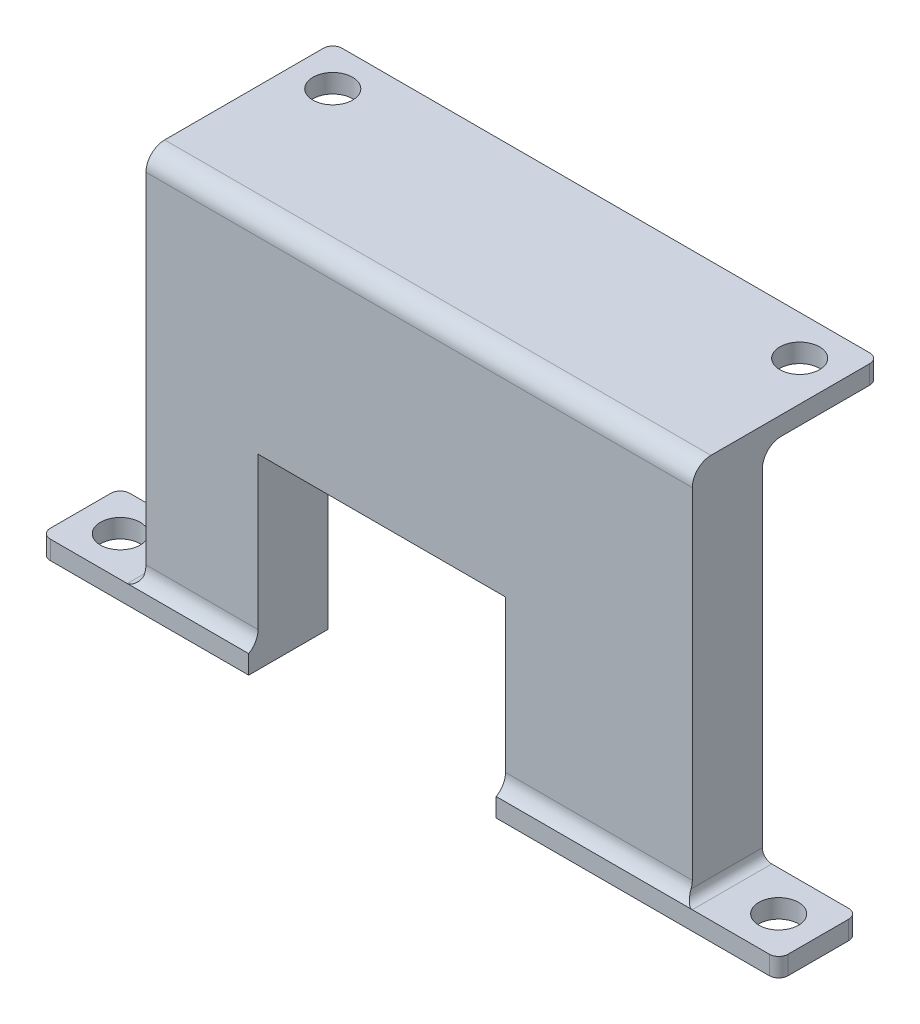
ISO-10303-21;
HEADER;
FILE_DESCRIPTION(('STEP AP214'),'2;1');
FILE_NAME('part.step','',(''),(''),'','','');
FILE_SCHEMA(('AUTOMOTIVE_DESIGN { 1 0 10303 214 1 1 1 1 }'));
ENDSEC;
DATA;
#1=APPLICATION_CONTEXT('core data for automotive mechanical design processes');
#2=APPLICATION_PROTOCOL_DEFINITION('international standard','automotive_design',2000,#1);
#3=PRODUCT_CONTEXT('',#1,'mechanical');
#4=PRODUCT('Part','Part','',(#3));
#5=PRODUCT_RELATED_PRODUCT_CATEGORY('part','',(#4));
#6=PRODUCT_DEFINITION_FORMATION('','',#4);
#7=PRODUCT_DEFINITION_CONTEXT('part definition',#1,'design');
#8=PRODUCT_DEFINITION('design','',#6,#7);
#9=PRODUCT_DEFINITION_SHAPE('','',#8);
#10=(LENGTH_UNIT() NAMED_UNIT(*) SI_UNIT(.MILLI.,.METRE.));
#11=(NAMED_UNIT(*) PLANE_ANGLE_UNIT() SI_UNIT($,.RADIAN.));
#12=(NAMED_UNIT(*) SI_UNIT($,.STERADIAN.) SOLID_ANGLE_UNIT());
#13=UNCERTAINTY_MEASURE_WITH_UNIT(LENGTH_MEASURE(1.E-05),#10,'distance_accuracy_value','');
#14=(GEOMETRIC_REPRESENTATION_CONTEXT(3) GLOBAL_UNCERTAINTY_ASSIGNED_CONTEXT((#13)) GLOBAL_UNIT_ASSIGNED_CONTEXT((#10,
#11,#12)) REPRESENTATION_CONTEXT('',''));
#15=CARTESIAN_POINT('',(0.,0.,0.));
#16=DIRECTION('',(0.,0.,1.));
#17=DIRECTION('',(1.,0.,0.));
#18=AXIS2_PLACEMENT_3D('',#15,#16,#17);
#19=CARTESIAN_POINT('',(0.,0.,0.));
#20=DIRECTION('',(0.,1.,0.));
#21=DIRECTION('',(0.,0.,1.));
#22=AXIS2_PLACEMENT_3D('',#19,#20,#21);
#23=PLANE('',#22);
#24=CARTESIAN_POINT('',(-4.25,0.,-4.24999999999998));
#25=DIRECTION('',(0.,1.,0.));
#26=DIRECTION('',(0.,0.,1.));
#27=AXIS2_PLACEMENT_3D('',#24,#25,#26);
#28=CIRCLE('',#27,2.125);
#29=CARTESIAN_POINT('',(-4.25,0.,-2.12499999999998));
#30=VERTEX_POINT('',#29);
#31=EDGE_CURVE('E429',#30,#30,#28,.T.);
#32=ORIENTED_EDGE('',*,*,#31,.T.);
#33=EDGE_LOOP('',(#32));
#34=FACE_BOUND('',#33,.T.);
#35=DIRECTION('',(1.,0.,0.));
#36=VECTOR('',#35,1.);
#37=CARTESIAN_POINT('',(0.,0.,0.));
#38=LINE('',#37,#36);
#39=CARTESIAN_POINT('',(-30.25,0.,0.));
#40=VERTEX_POINT('',#39);
#41=CARTESIAN_POINT('',(-1.,0.,0.));
#42=VERTEX_POINT('',#41);
#43=EDGE_CURVE('E235',#40,#42,#38,.T.);
#44=ORIENTED_EDGE('',*,*,#43,.F.);
#45=DIRECTION('',(0.,0.,-1.));
#46=VECTOR('',#45,1.);
#47=CARTESIAN_POINT('',(-30.25,0.,1.50000000000001));
#48=LINE('',#47,#46);
#49=CARTESIAN_POINT('',(-30.25,0.,-8.49999999999999));
#50=VERTEX_POINT('',#49);
#51=EDGE_CURVE('E220',#40,#50,#48,.T.);
#52=ORIENTED_EDGE('',*,*,#51,.T.);
#53=DIRECTION('',(-1.,0.,0.));
#54=VECTOR('',#53,1.);
#55=CARTESIAN_POINT('',(0.,0.,-8.5));
#56=LINE('',#55,#54);
#57=CARTESIAN_POINT('',(-1.,0.,-8.5));
#58=VERTEX_POINT('',#57);
#59=EDGE_CURVE('E233',#58,#50,#56,.T.);
#60=ORIENTED_EDGE('',*,*,#59,.F.);
#61=CARTESIAN_POINT('',(-1.,0.,-7.5));
#62=DIRECTION('',(0.,1.,0.));
#63=DIRECTION('',(0.,0.,1.));
#64=AXIS2_PLACEMENT_3D('',#61,#62,#63);
#65=CIRCLE('',#64,1.);
#66=CARTESIAN_POINT('',(0.,0.,-7.5));
#67=VERTEX_POINT('',#66);
#68=EDGE_CURVE('E294',#58,#67,#65,.F.);
#69=ORIENTED_EDGE('',*,*,#68,.T.);
#70=DIRECTION('',(0.,0.,-1.));
#71=VECTOR('',#70,1.);
#72=CARTESIAN_POINT('',(0.,0.,0.));
#73=LINE('',#72,#71);
#74=CARTESIAN_POINT('',(0.,0.,-1.));
#75=VERTEX_POINT('',#74);
#76=EDGE_CURVE('E249',#75,#67,#73,.T.);
#77=ORIENTED_EDGE('',*,*,#76,.F.);
#78=CARTESIAN_POINT('',(-1.,0.,-1.));
#79=DIRECTION('',(0.,1.,0.));
#80=DIRECTION('',(0.,0.,1.));
#81=AXIS2_PLACEMENT_3D('',#78,#79,#80);
#82=CIRCLE('',#81,1.);
#83=EDGE_CURVE('E292',#75,#42,#82,.F.);
#84=ORIENTED_EDGE('',*,*,#83,.T.);
#85=EDGE_LOOP('',(#44,#52,#60,#69,#77,#84));
#86=FACE_BOUND('',#85,.T.);
#87=ADVANCED_FACE('F35',(#34,#86),#23,.F.);
#88=CARTESIAN_POINT('',(0.,2.,0.));
#89=DIRECTION('',(0.,0.,-1.));
#90=DIRECTION('',(-1.,0.,0.));
#91=AXIS2_PLACEMENT_3D('',#88,#89,#90);
#92=PLANE('',#91);
#93=DIRECTION('',(1.,0.,0.));
#94=VECTOR('',#93,1.);
#95=CARTESIAN_POINT('',(0.,2.,0.));
#96=LINE('',#95,#94);
#97=CARTESIAN_POINT('',(-30.25,2.,0.));
#98=VERTEX_POINT('',#97);
#99=CARTESIAN_POINT('',(-9.25,2.,0.));
#100=VERTEX_POINT('',#99);
#101=EDGE_CURVE('E506',#98,#100,#96,.T.);
#102=ORIENTED_EDGE('',*,*,#101,.F.);
#103=DIRECTION('',(0.,-1.,0.));
#104=VECTOR('',#103,1.);
#105=CARTESIAN_POINT('',(-30.25,2.,0.));
#106=LINE('',#105,#104);
#107=EDGE_CURVE('E463',#98,#40,#106,.T.);
#108=ORIENTED_EDGE('',*,*,#107,.T.);
#109=ORIENTED_EDGE('',*,*,#43,.T.);
#110=DIRECTION('',(0.,-1.,0.));
#111=VECTOR('',#110,1.);
#112=CARTESIAN_POINT('',(-1.,2.,0.));
#113=LINE('',#112,#111);
#114=CARTESIAN_POINT('',(-1.,2.,0.));
#115=VERTEX_POINT('',#114);
#116=EDGE_CURVE('E286',#42,#115,#113,.F.);
#117=ORIENTED_EDGE('',*,*,#116,.T.);
#118=EDGE_CURVE('E508',#100,#115,#96,.T.);
#119=ORIENTED_EDGE('',*,*,#118,.F.);
#120=EDGE_LOOP('',(#102,#108,#109,#117,#119));
#121=FACE_BOUND('',#120,.T.);
#122=ADVANCED_FACE('F390',(#121),#92,.F.);
#123=CARTESIAN_POINT('',(0.,3.73205080756886,1.00000000000002));
#124=DIRECTION('',(-1.,0.,0.));
#125=DIRECTION('',(0.,0.,1.));
#126=AXIS2_PLACEMENT_3D('',#123,#124,#125);
#127=CYLINDRICAL_SURFACE('',#126,2.);
#128=DIRECTION('',(-1.,0.,0.));
#129=VECTOR('',#128,1.);
#130=CARTESIAN_POINT('',(-68.75,3.73205080756887,-0.999999999999978));
#131=LINE('',#130,#129);
#132=CARTESIAN_POINT('',(-30.25,3.73205080756886,-0.999999999999972));
#133=VERTEX_POINT('',#132);
#134=CARTESIAN_POINT('',(-10.25,3.73205080756887,-0.999999999999978));
#135=VERTEX_POINT('',#134);
#136=EDGE_CURVE('E271',#133,#135,#131,.F.);
#137=ORIENTED_EDGE('',*,*,#136,.F.);
#138=CARTESIAN_POINT('',(-30.25,3.73205080756886,1.00000000000003));
#139=DIRECTION('',(1.,0.,0.));
#140=DIRECTION('',(0.,0.,-1.));
#141=AXIS2_PLACEMENT_3D('',#138,#139,#140);
#142=CIRCLE('',#141,2.);
#143=EDGE_CURVE('E44',#133,#98,#142,.F.);
#144=ORIENTED_EDGE('',*,*,#143,.T.);
#145=ORIENTED_EDGE('',*,*,#101,.T.);
#146=CARTESIAN_POINT('',(-9.25,2.,0.));
#147=CARTESIAN_POINT('',(-9.28204293584676,1.99996270677827,0.000105056896792277));
#148=CARTESIAN_POINT('',(-9.31391923819955,2.00153733478133,-0.00266594161055841));
#149=CARTESIAN_POINT('',(-9.37615636194955,2.00751511967625,-0.0129319121744202));
#150=CARTESIAN_POINT('',(-9.40653277473787,2.01187533262256,-0.0203551308215819));
#151=CARTESIAN_POINT('',(-9.47609775863592,2.02503639817772,-0.0422589518009055));
#152=CARTESIAN_POINT('',(-9.51457806926211,2.03486506332716,-0.0583105844516009));
#153=CARTESIAN_POINT('',(-9.5884138884665,2.05820001482211,-0.0948528513043988));
#154=CARTESIAN_POINT('',(-9.62374287340889,2.07173420784688,-0.115376918258168));
#155=CARTESIAN_POINT('',(-9.71486456876501,2.1123877418115,-0.174176470703826));
#156=CARTESIAN_POINT('',(-9.76778760998959,2.14240644115113,-0.214865323486755));
#157=CARTESIAN_POINT('',(-9.86610231660123,2.21008221598442,-0.298670996286555));
#158=CARTESIAN_POINT('',(-9.91149042866344,2.24774287677848,-0.341788949054834));
#159=CARTESIAN_POINT('',(-9.99758602612562,2.33292082844585,-0.430538310903922));
#160=CARTESIAN_POINT('',(-10.0378514190134,2.38089280692986,-0.476165864174636));
#161=CARTESIAN_POINT('',(-10.1094923893885,2.48497386786247,-0.565079802932267));
#162=CARTESIAN_POINT('',(-10.1408754334984,2.54107605559522,-0.608368129886636));
#163=CARTESIAN_POINT('',(-10.1884198584878,2.65033763609612,-0.683295675281441));
#164=CARTESIAN_POINT('',(-10.2062912099146,2.70226464503005,-0.715641552477935));
#165=CARTESIAN_POINT('',(-10.2334575424052,2.81052399920384,-0.776117018182799));
#166=CARTESIAN_POINT('',(-10.2427801335671,2.86684152029218,-0.804259932773353));
#167=CARTESIAN_POINT('',(-10.2490389328819,2.94950322528801,-0.840755234223115));
#168=CARTESIAN_POINT('',(-10.2500058236714,2.97464718641001,-0.851249090462055));
#169=CARTESIAN_POINT('',(-10.25,3.,-0.861209718204182));
#170=B_SPLINE_CURVE_WITH_KNOTS('',3,(#146,#147,#148,#149,#150,#151,#152,#153,#154,#155,#156,
#157,#158,#159,#160,#161,#162,#163,#164,#165,#166,#167,#168,#169),.UNSPECIFIED.,.F.,.F.,(4,2,2,
2,2,2,2,2,2,2,2,4),(0.,0.095703862884156,0.189966786013492,0.317754948543979,0.446533304371925,
0.664934652694651,0.883438704027361,1.11500673255226,1.34637951975566,1.53685909927753,
1.72672129386952,1.80843162421715),.UNSPECIFIED.);
#171=CARTESIAN_POINT('',(-10.25,3.,-0.861209718204181));
#172=VERTEX_POINT('',#171);
#173=EDGE_CURVE('E350',#100,#172,#170,.T.);
#174=ORIENTED_EDGE('',*,*,#173,.T.);
#175=CARTESIAN_POINT('',(-10.25,3.73205080756886,1.00000000000002));
#176=DIRECTION('',(-1.,0.,0.));
#177=DIRECTION('',(0.,0.,1.));
#178=AXIS2_PLACEMENT_3D('',#175,#176,#177);
#179=CIRCLE('',#178,2.);
#180=EDGE_CURVE('E281',#135,#172,#179,.T.);
#181=ORIENTED_EDGE('',*,*,#180,.F.);
#182=EDGE_LOOP('',(#137,#144,#145,#174,#181));
#183=FACE_BOUND('',#182,.T.);
#184=ADVANCED_FACE('F346',(#183),#127,.F.);
#185=CARTESIAN_POINT('',(0.,2.,0.));
#186=DIRECTION('',(0.,1.,0.));
#187=DIRECTION('',(0.,0.,1.));
#188=AXIS2_PLACEMENT_3D('',#185,#186,#187);
#189=PLANE('',#188);
#190=CARTESIAN_POINT('',(-4.25,2.,-4.24999999999998));
#191=DIRECTION('',(0.,1.,0.));
#192=DIRECTION('',(0.,0.,1.));
#193=AXIS2_PLACEMENT_3D('',#190,#191,#192);
#194=CIRCLE('',#193,2.125);
#195=CARTESIAN_POINT('',(-4.25,2.,-2.12499999999998));
#196=VERTEX_POINT('',#195);
#197=EDGE_CURVE('E425',#196,#196,#194,.T.);
#198=ORIENTED_EDGE('',*,*,#197,.F.);
#199=EDGE_LOOP('',(#198));
#200=FACE_BOUND('',#199,.T.);
#201=DIRECTION('',(-1.,0.,0.));
#202=VECTOR('',#201,1.);
#203=CARTESIAN_POINT('',(0.,2.,-8.5));
#204=LINE('',#203,#202);
#205=CARTESIAN_POINT('',(-1.,2.,-8.5));
#206=VERTEX_POINT('',#205);
#207=CARTESIAN_POINT('',(-9.25000000000001,2.,-8.5));
#208=VERTEX_POINT('',#207);
#209=EDGE_CURVE('E310',#206,#208,#204,.T.);
#210=ORIENTED_EDGE('',*,*,#209,.T.);
#211=DIRECTION('',(0.,0.,-1.));
#212=VECTOR('',#211,1.);
#213=CARTESIAN_POINT('',(-9.25,2.,0.));
#214=LINE('',#213,#212);
#215=EDGE_CURVE('E567',#208,#100,#214,.F.);
#216=ORIENTED_EDGE('',*,*,#215,.T.);
#217=ORIENTED_EDGE('',*,*,#118,.T.);
#218=CARTESIAN_POINT('',(-1.,2.,-1.));
#219=DIRECTION('',(0.,1.,0.));
#220=DIRECTION('',(0.,0.,1.));
#221=AXIS2_PLACEMENT_3D('',#218,#219,#220);
#222=CIRCLE('',#221,1.);
#223=CARTESIAN_POINT('',(0.,2.,-1.));
#224=VERTEX_POINT('',#223);
#225=EDGE_CURVE('E552',#115,#224,#222,.T.);
#226=ORIENTED_EDGE('',*,*,#225,.T.);
#227=DIRECTION('',(0.,0.,-1.));
#228=VECTOR('',#227,1.);
#229=CARTESIAN_POINT('',(0.,2.,0.));
#230=LINE('',#229,#228);
#231=CARTESIAN_POINT('',(0.,2.,-7.5));
#232=VERTEX_POINT('',#231);
#233=EDGE_CURVE('E256',#224,#232,#230,.T.);
#234=ORIENTED_EDGE('',*,*,#233,.T.);
#235=CARTESIAN_POINT('',(-1.,2.,-7.5));
#236=DIRECTION('',(0.,1.,0.));
#237=DIRECTION('',(0.,0.,1.));
#238=AXIS2_PLACEMENT_3D('',#235,#236,#237);
#239=CIRCLE('',#238,1.);
#240=EDGE_CURVE('E554',#232,#206,#239,.T.);
#241=ORIENTED_EDGE('',*,*,#240,.T.);
#242=EDGE_LOOP('',(#210,#216,#217,#226,#234,#241));
#243=FACE_BOUND('',#242,.T.);
#244=ADVANCED_FACE('F416',(#200,#243),#189,.T.);
#245=CARTESIAN_POINT('',(0.,2.,-8.5));
#246=DIRECTION('',(0.,0.,1.));
#247=DIRECTION('',(1.,0.,0.));
#248=AXIS2_PLACEMENT_3D('',#245,#246,#247);
#249=PLANE('',#248);
#250=ORIENTED_EDGE('',*,*,#59,.T.);
#251=DIRECTION('',(0.,-1.,0.));
#252=VECTOR('',#251,1.);
#253=CARTESIAN_POINT('',(-30.25,0.,-8.49999999999999));
#254=LINE('',#253,#252);
#255=CARTESIAN_POINT('',(-30.25,20.,-8.49999999999999));
#256=VERTEX_POINT('',#255);
#257=EDGE_CURVE('E217',#256,#50,#254,.T.);
#258=ORIENTED_EDGE('',*,*,#257,.F.);
#259=DIRECTION('',(1.,0.,0.));
#260=VECTOR('',#259,1.);
#261=CARTESIAN_POINT('',(-30.25,20.,-8.49999999999999));
#262=LINE('',#261,#260);
#263=CARTESIAN_POINT('',(-56.75,20.,-8.49999999999998));
#264=VERTEX_POINT('',#263);
#265=EDGE_CURVE('E237',#264,#256,#262,.T.);
#266=ORIENTED_EDGE('',*,*,#265,.F.);
#267=DIRECTION('',(0.,1.,0.));
#268=VECTOR('',#267,1.);
#269=CARTESIAN_POINT('',(-56.75,0.,-8.49999999999998));
#270=LINE('',#269,#268);
#271=CARTESIAN_POINT('',(-56.75,0.,-8.49999999999998));
#272=VERTEX_POINT('',#271);
#273=EDGE_CURVE('E228',#272,#264,#270,.T.);
#274=ORIENTED_EDGE('',*,*,#273,.F.);
#275=CARTESIAN_POINT('',(-78.,0.,-8.49999999999998));
#276=VERTEX_POINT('',#275);
#277=EDGE_CURVE('E245',#272,#276,#56,.T.);
#278=ORIENTED_EDGE('',*,*,#277,.T.);
#279=DIRECTION('',(0.,-1.,0.));
#280=VECTOR('',#279,1.);
#281=CARTESIAN_POINT('',(-78.,2.,-8.49999999999998));
#282=LINE('',#281,#280);
#283=CARTESIAN_POINT('',(-78.,2.,-8.49999999999998));
#284=VERTEX_POINT('',#283);
#285=EDGE_CURVE('E521',#276,#284,#282,.F.);
#286=ORIENTED_EDGE('',*,*,#285,.T.);
#287=CARTESIAN_POINT('',(-69.75,2.,-8.49999999999998));
#288=VERTEX_POINT('',#287);
#289=EDGE_CURVE('E315',#288,#284,#204,.T.);
#290=ORIENTED_EDGE('',*,*,#289,.F.);
#291=CARTESIAN_POINT('',(-69.75,3.,-8.49999999999998));
#292=DIRECTION('',(0.,0.,1.));
#293=DIRECTION('',(1.,0.,0.));
#294=AXIS2_PLACEMENT_3D('',#291,#292,#293);
#295=CIRCLE('',#294,1.);
#296=CARTESIAN_POINT('',(-68.75,3.,-8.49999999999998));
#297=VERTEX_POINT('',#296);
#298=EDGE_CURVE('E336',#288,#297,#295,.T.);
#299=ORIENTED_EDGE('',*,*,#298,.T.);
#300=DIRECTION('',(0.,-1.,0.));
#301=VECTOR('',#300,1.);
#302=CARTESIAN_POINT('',(-68.75,42.14,-8.49999999999998));
#303=LINE('',#302,#301);
#304=CARTESIAN_POINT('',(-68.75,38.14,-8.49999999999998));
#305=VERTEX_POINT('',#304);
#306=EDGE_CURVE('E262',#305,#297,#303,.T.);
#307=ORIENTED_EDGE('',*,*,#306,.F.);
#308=DIRECTION('',(-1.,0.,0.));
#309=VECTOR('',#308,1.);
#310=CARTESIAN_POINT('',(-10.25,38.14,-8.5));
#311=LINE('',#310,#309);
#312=CARTESIAN_POINT('',(-10.25,38.14,-8.49999999999999));
#313=VERTEX_POINT('',#312);
#314=EDGE_CURVE('E269',#305,#313,#311,.F.);
#315=ORIENTED_EDGE('',*,*,#314,.T.);
#316=DIRECTION('',(0.,-1.,0.));
#317=VECTOR('',#316,1.);
#318=CARTESIAN_POINT('',(-10.25,42.14,-8.49999999999999));
#319=LINE('',#318,#317);
#320=CARTESIAN_POINT('',(-10.25,3.,-8.49999999999999));
#321=VERTEX_POINT('',#320);
#322=EDGE_CURVE('E266',#313,#321,#319,.T.);
#323=ORIENTED_EDGE('',*,*,#322,.T.);
#324=CARTESIAN_POINT('',(-9.25000000000001,3.,-8.5));
#325=DIRECTION('',(0.,0.,1.));
#326=DIRECTION('',(1.,0.,0.));
#327=AXIS2_PLACEMENT_3D('',#324,#325,#326);
#328=CIRCLE('',#327,1.);
#329=EDGE_CURVE('E355',#321,#208,#328,.T.);
#330=ORIENTED_EDGE('',*,*,#329,.T.);
#331=ORIENTED_EDGE('',*,*,#209,.F.);
#332=DIRECTION('',(0.,-1.,0.));
#333=VECTOR('',#332,1.);
#334=CARTESIAN_POINT('',(-1.,2.,-8.5));
#335=LINE('',#334,#333);
#336=EDGE_CURVE('E243',#206,#58,#335,.T.);
#337=ORIENTED_EDGE('',*,*,#336,.T.);
#338=EDGE_LOOP('',(#250,#258,#266,#274,#278,#286,#290,#299,#307,#315,#323,#330,#331,#337));
#339=FACE_BOUND('',#338,.T.);
#340=ADVANCED_FACE('F240',(#339),#249,.F.);
#341=CARTESIAN_POINT('',(-78.,2.,0.));
#342=VERTEX_POINT('',#341);
#343=CARTESIAN_POINT('',(-69.75,2.,0.));
#344=VERTEX_POINT('',#343);
#345=EDGE_CURVE('E502',#342,#344,#96,.T.);
#346=ORIENTED_EDGE('',*,*,#345,.T.);
#347=DIRECTION('',(0.,0.,1.));
#348=VECTOR('',#347,1.);
#349=CARTESIAN_POINT('',(-69.75,2.,0.));
#350=LINE('',#349,#348);
#351=EDGE_CURVE('E327',#344,#288,#350,.F.);
#352=ORIENTED_EDGE('',*,*,#351,.T.);
#353=ORIENTED_EDGE('',*,*,#289,.T.);
#354=CARTESIAN_POINT('',(-78.,2.,-7.49999999999998));
#355=DIRECTION('',(0.,1.,0.));
#356=DIRECTION('',(0.,0.,1.));
#357=AXIS2_PLACEMENT_3D('',#354,#355,#356);
#358=CIRCLE('',#357,1.);
#359=CARTESIAN_POINT('',(-79.,2.,-7.49999999999998));
#360=VERTEX_POINT('',#359);
#361=EDGE_CURVE('E306',#284,#360,#358,.T.);
#362=ORIENTED_EDGE('',*,*,#361,.T.);
#363=DIRECTION('',(0.,0.,1.));
#364=VECTOR('',#363,1.);
#365=CARTESIAN_POINT('',(-79.,2.,0.));
#366=LINE('',#365,#364);
#367=CARTESIAN_POINT('',(-79.,2.,-0.999999999999985));
#368=VERTEX_POINT('',#367);
#369=EDGE_CURVE('E314',#360,#368,#366,.T.);
#370=ORIENTED_EDGE('',*,*,#369,.T.);
#371=CARTESIAN_POINT('',(-78.,2.,-0.999999999999985));
#372=DIRECTION('',(0.,1.,0.));
#373=DIRECTION('',(0.,0.,1.));
#374=AXIS2_PLACEMENT_3D('',#371,#372,#373);
#375=CIRCLE('',#374,1.);
#376=EDGE_CURVE('E308',#368,#342,#375,.T.);
#377=ORIENTED_EDGE('',*,*,#376,.T.);
#378=EDGE_LOOP('',(#346,#352,#353,#362,#370,#377));
#379=FACE_BOUND('',#378,.T.);
#380=CARTESIAN_POINT('',(-74.75,2.,-4.24999999999998));
#381=DIRECTION('',(0.,1.,0.));
#382=DIRECTION('',(0.,0.,1.));
#383=AXIS2_PLACEMENT_3D('',#380,#381,#382);
#384=CIRCLE('',#383,2.125);
#385=CARTESIAN_POINT('',(-74.75,2.,-2.12499999999998));
#386=VERTEX_POINT('',#385);
#387=EDGE_CURVE('E424',#386,#386,#384,.T.);
#388=ORIENTED_EDGE('',*,*,#387,.F.);
#389=EDGE_LOOP('',(#388));
#390=FACE_BOUND('',#389,.T.);
#391=ADVANCED_FACE('F405',(#379,#390),#189,.T.);
#392=ORIENTED_EDGE('',*,*,#277,.F.);
#393=DIRECTION('',(0.,0.,-1.));
#394=VECTOR('',#393,1.);
#395=CARTESIAN_POINT('',(-56.75,0.,1.50000000000002));
#396=LINE('',#395,#394);
#397=CARTESIAN_POINT('',(-56.75,0.,0.));
#398=VERTEX_POINT('',#397);
#399=EDGE_CURVE('E236',#398,#272,#396,.T.);
#400=ORIENTED_EDGE('',*,*,#399,.F.);
#401=CARTESIAN_POINT('',(-78.,0.,0.));
#402=VERTEX_POINT('',#401);
#403=EDGE_CURVE('E253',#402,#398,#38,.T.);
#404=ORIENTED_EDGE('',*,*,#403,.F.);
#405=CARTESIAN_POINT('',(-78.,0.,-0.999999999999985));
#406=DIRECTION('',(0.,1.,0.));
#407=DIRECTION('',(0.,0.,1.));
#408=AXIS2_PLACEMENT_3D('',#405,#406,#407);
#409=CIRCLE('',#408,1.);
#410=CARTESIAN_POINT('',(-79.,0.,-0.999999999999985));
#411=VERTEX_POINT('',#410);
#412=EDGE_CURVE('E299',#402,#411,#409,.F.);
#413=ORIENTED_EDGE('',*,*,#412,.T.);
#414=DIRECTION('',(0.,0.,1.));
#415=VECTOR('',#414,1.);
#416=CARTESIAN_POINT('',(-79.,0.,0.));
#417=LINE('',#416,#415);
#418=CARTESIAN_POINT('',(-79.,0.,-7.49999999999998));
#419=VERTEX_POINT('',#418);
#420=EDGE_CURVE('E244',#419,#411,#417,.T.);
#421=ORIENTED_EDGE('',*,*,#420,.F.);
#422=CARTESIAN_POINT('',(-78.,0.,-7.49999999999998));
#423=DIRECTION('',(0.,1.,0.));
#424=DIRECTION('',(0.,0.,1.));
#425=AXIS2_PLACEMENT_3D('',#422,#423,#424);
#426=CIRCLE('',#425,1.);
#427=EDGE_CURVE('E296',#419,#276,#426,.F.);
#428=ORIENTED_EDGE('',*,*,#427,.T.);
#429=EDGE_LOOP('',(#392,#400,#404,#413,#421,#428));
#430=FACE_BOUND('',#429,.T.);
#431=CARTESIAN_POINT('',(-74.75,0.,-4.24999999999998));
#432=DIRECTION('',(0.,1.,0.));
#433=DIRECTION('',(0.,0.,1.));
#434=AXIS2_PLACEMENT_3D('',#431,#432,#433);
#435=CIRCLE('',#434,2.125);
#436=CARTESIAN_POINT('',(-74.75,0.,-2.12499999999998));
#437=VERTEX_POINT('',#436);
#438=EDGE_CURVE('E422',#437,#437,#435,.T.);
#439=ORIENTED_EDGE('',*,*,#438,.T.);
#440=EDGE_LOOP('',(#439));
#441=FACE_BOUND('',#440,.T.);
#442=ADVANCED_FACE('F393',(#430,#441),#23,.F.);
#443=CARTESIAN_POINT('',(0.,2.,0.));
#444=DIRECTION('',(-1.,0.,0.));
#445=DIRECTION('',(0.,0.,1.));
#446=AXIS2_PLACEMENT_3D('',#443,#444,#445);
#447=PLANE('',#446);
#448=ORIENTED_EDGE('',*,*,#76,.T.);
#449=DIRECTION('',(0.,-1.,0.));
#450=VECTOR('',#449,1.);
#451=CARTESIAN_POINT('',(0.,2.,-7.5));
#452=LINE('',#451,#450);
#453=EDGE_CURVE('E550',#67,#232,#452,.F.);
#454=ORIENTED_EDGE('',*,*,#453,.T.);
#455=ORIENTED_EDGE('',*,*,#233,.F.);
#456=DIRECTION('',(0.,-1.,0.));
#457=VECTOR('',#456,1.);
#458=CARTESIAN_POINT('',(0.,2.,-1.));
#459=LINE('',#458,#457);
#460=EDGE_CURVE('E547',#224,#75,#459,.T.);
#461=ORIENTED_EDGE('',*,*,#460,.T.);
#462=EDGE_LOOP('',(#448,#454,#455,#461));
#463=FACE_BOUND('',#462,.T.);
#464=ADVANCED_FACE('F404',(#463),#447,.F.);
#465=CARTESIAN_POINT('',(-79.,2.,0.));
#466=DIRECTION('',(1.,0.,0.));
#467=DIRECTION('',(0.,0.,-1.));
#468=AXIS2_PLACEMENT_3D('',#465,#466,#467);
#469=PLANE('',#468);
#470=ORIENTED_EDGE('',*,*,#420,.T.);
#471=DIRECTION('',(0.,-1.,0.));
#472=VECTOR('',#471,1.);
#473=CARTESIAN_POINT('',(-79.,2.,-0.999999999999985));
#474=LINE('',#473,#472);
#475=EDGE_CURVE('E304',#411,#368,#474,.F.);
#476=ORIENTED_EDGE('',*,*,#475,.T.);
#477=ORIENTED_EDGE('',*,*,#369,.F.);
#478=DIRECTION('',(0.,-1.,0.));
#479=VECTOR('',#478,1.);
#480=CARTESIAN_POINT('',(-79.,2.,-7.49999999999998));
#481=LINE('',#480,#479);
#482=EDGE_CURVE('E301',#360,#419,#481,.T.);
#483=ORIENTED_EDGE('',*,*,#482,.T.);
#484=EDGE_LOOP('',(#470,#476,#477,#483));
#485=FACE_BOUND('',#484,.T.);
#486=ADVANCED_FACE('F412',(#485),#469,.F.);
#487=ORIENTED_EDGE('',*,*,#403,.T.);
#488=DIRECTION('',(0.,1.,0.));
#489=VECTOR('',#488,1.);
#490=CARTESIAN_POINT('',(-56.75,2.,0.));
#491=LINE('',#490,#489);
#492=CARTESIAN_POINT('',(-56.75,2.,0.));
#493=VERTEX_POINT('',#492);
#494=EDGE_CURVE('E468',#398,#493,#491,.T.);
#495=ORIENTED_EDGE('',*,*,#494,.T.);
#496=EDGE_CURVE('E59',#344,#493,#96,.T.);
#497=ORIENTED_EDGE('',*,*,#496,.F.);
#498=ORIENTED_EDGE('',*,*,#345,.F.);
#499=DIRECTION('',(0.,-1.,0.));
#500=VECTOR('',#499,1.);
#501=CARTESIAN_POINT('',(-78.,2.,0.));
#502=LINE('',#501,#500);
#503=EDGE_CURVE('E289',#342,#402,#502,.T.);
#504=ORIENTED_EDGE('',*,*,#503,.T.);
#505=EDGE_LOOP('',(#487,#495,#497,#498,#504));
#506=FACE_BOUND('',#505,.T.);
#507=ADVANCED_FACE('F400',(#506),#92,.F.);
#508=CARTESIAN_POINT('',(-74.75,2.,-4.24999999999998));
#509=DIRECTION('',(0.,-1.,0.));
#510=DIRECTION('',(0.,0.,-1.));
#511=AXIS2_PLACEMENT_3D('',#508,#509,#510);
#512=CYLINDRICAL_SURFACE('',#511,2.125);
#513=ORIENTED_EDGE('',*,*,#387,.T.);
#514=EDGE_LOOP('',(#513));
#515=FACE_BOUND('',#514,.T.);
#516=ORIENTED_EDGE('',*,*,#438,.F.);
#517=EDGE_LOOP('',(#516));
#518=FACE_BOUND('',#517,.T.);
#519=ADVANCED_FACE('F638',(#515,#518),#512,.F.);
#520=CARTESIAN_POINT('',(-4.25,2.,-4.24999999999998));
#521=DIRECTION('',(0.,-1.,0.));
#522=DIRECTION('',(0.,0.,-1.));
#523=AXIS2_PLACEMENT_3D('',#520,#521,#522);
#524=CYLINDRICAL_SURFACE('',#523,2.125);
#525=ORIENTED_EDGE('',*,*,#197,.T.);
#526=EDGE_LOOP('',(#525));
#527=FACE_BOUND('',#526,.T.);
#528=ORIENTED_EDGE('',*,*,#31,.F.);
#529=EDGE_LOOP('',(#528));
#530=FACE_BOUND('',#529,.T.);
#531=ADVANCED_FACE('F635',(#527,#530),#524,.F.);
#532=CARTESIAN_POINT('',(-10.25,42.14,-0.999999999999978));
#533=DIRECTION('',(-1.,0.,0.));
#534=DIRECTION('',(0.,0.,1.));
#535=AXIS2_PLACEMENT_3D('',#532,#533,#534);
#536=PLANE('',#535);
#537=ORIENTED_EDGE('',*,*,#180,.T.);
#538=DIRECTION('',(0.,0.,-1.));
#539=VECTOR('',#538,1.);
#540=CARTESIAN_POINT('',(-10.25,3.,-0.999999999999978));
#541=LINE('',#540,#539);
#542=EDGE_CURVE('E565',#172,#321,#541,.T.);
#543=ORIENTED_EDGE('',*,*,#542,.T.);
#544=ORIENTED_EDGE('',*,*,#322,.F.);
#545=CARTESIAN_POINT('',(-10.25,38.14,-10.5));
#546=DIRECTION('',(-1.,0.,0.));
#547=DIRECTION('',(0.,0.,1.));
#548=AXIS2_PLACEMENT_3D('',#545,#546,#547);
#549=CIRCLE('',#548,2.);
#550=CARTESIAN_POINT('',(-10.25,40.14,-10.5));
#551=VERTEX_POINT('',#550);
#552=EDGE_CURVE('E278',#313,#551,#549,.T.);
#553=ORIENTED_EDGE('',*,*,#552,.T.);
#554=DIRECTION('',(0.,0.,1.));
#555=VECTOR('',#554,1.);
#556=CARTESIAN_POINT('',(-10.25,40.14,-21.));
#557=LINE('',#556,#555);
#558=CARTESIAN_POINT('',(-10.25,40.14,-20.));
#559=VERTEX_POINT('',#558);
#560=EDGE_CURVE('E443',#559,#551,#557,.T.);
#561=ORIENTED_EDGE('',*,*,#560,.F.);
#562=DIRECTION('',(0.,-1.,0.));
#563=VECTOR('',#562,1.);
#564=CARTESIAN_POINT('',(-10.25,42.14,-20.));
#565=LINE('',#564,#563);
#566=CARTESIAN_POINT('',(-10.25,42.14,-20.));
#567=VERTEX_POINT('',#566);
#568=EDGE_CURVE('E544',#559,#567,#565,.F.);
#569=ORIENTED_EDGE('',*,*,#568,.T.);
#570=DIRECTION('',(0.,0.,-1.));
#571=VECTOR('',#570,1.);
#572=CARTESIAN_POINT('',(-10.25,42.14,-0.999999999999978));
#573=LINE('',#572,#571);
#574=CARTESIAN_POINT('',(-10.25,42.14,-2.99999999999998));
#575=VERTEX_POINT('',#574);
#576=EDGE_CURVE('E441',#575,#567,#573,.T.);
#577=ORIENTED_EDGE('',*,*,#576,.F.);
#578=CARTESIAN_POINT('',(-10.25,40.14,-2.99999999999998));
#579=DIRECTION('',(-1.,0.,0.));
#580=DIRECTION('',(0.,0.,1.));
#581=AXIS2_PLACEMENT_3D('',#578,#579,#580);
#582=CIRCLE('',#581,2.);
#583=CARTESIAN_POINT('',(-10.25,40.14,-0.999999999999978));
#584=VERTEX_POINT('',#583);
#585=EDGE_CURVE('E559',#575,#584,#582,.F.);
#586=ORIENTED_EDGE('',*,*,#585,.T.);
#587=DIRECTION('',(0.,-1.,0.));
#588=VECTOR('',#587,1.);
#589=CARTESIAN_POINT('',(-10.25,42.14,-0.999999999999978));
#590=LINE('',#589,#588);
#591=EDGE_CURVE('E435',#584,#135,#590,.T.);
#592=ORIENTED_EDGE('',*,*,#591,.T.);
#593=EDGE_LOOP('',(#537,#543,#544,#553,#561,#569,#577,#586,#592));
#594=FACE_BOUND('',#593,.T.);
#595=ADVANCED_FACE('F577',(#594),#536,.F.);
#596=CARTESIAN_POINT('',(-68.75,42.14,-0.999999999999978));
#597=DIRECTION('',(1.,0.,0.));
#598=DIRECTION('',(0.,0.,-1.));
#599=AXIS2_PLACEMENT_3D('',#596,#597,#598);
#600=PLANE('',#599);
#601=ORIENTED_EDGE('',*,*,#306,.T.);
#602=DIRECTION('',(0.,0.,1.));
#603=VECTOR('',#602,1.);
#604=CARTESIAN_POINT('',(-68.75,3.,-0.999999999999978));
#605=LINE('',#604,#603);
#606=CARTESIAN_POINT('',(-68.75,3.,-0.86120971820417));
#607=VERTEX_POINT('',#606);
#608=EDGE_CURVE('E325',#297,#607,#605,.T.);
#609=ORIENTED_EDGE('',*,*,#608,.T.);
#610=CARTESIAN_POINT('',(-68.75,3.73205080756886,1.00000000000004));
#611=DIRECTION('',(1.,0.,0.));
#612=DIRECTION('',(0.,0.,-1.));
#613=AXIS2_PLACEMENT_3D('',#610,#611,#612);
#614=CIRCLE('',#613,2.);
#615=CARTESIAN_POINT('',(-68.75,3.73205080756887,-0.999999999999978));
#616=VERTEX_POINT('',#615);
#617=EDGE_CURVE('E284',#607,#616,#614,.T.);
#618=ORIENTED_EDGE('',*,*,#617,.T.);
#619=DIRECTION('',(0.,-1.,0.));
#620=VECTOR('',#619,1.);
#621=CARTESIAN_POINT('',(-68.75,42.14,-0.999999999999978));
#622=LINE('',#621,#620);
#623=CARTESIAN_POINT('',(-68.75,40.14,-0.999999999999978));
#624=VERTEX_POINT('',#623);
#625=EDGE_CURVE('E267',#624,#616,#622,.T.);
#626=ORIENTED_EDGE('',*,*,#625,.F.);
#627=CARTESIAN_POINT('',(-68.75,40.14,-2.99999999999998));
#628=DIRECTION('',(1.,0.,0.));
#629=DIRECTION('',(0.,0.,-1.));
#630=AXIS2_PLACEMENT_3D('',#627,#628,#629);
#631=CIRCLE('',#630,2.);
#632=CARTESIAN_POINT('',(-68.75,42.14,-2.99999999999998));
#633=VERTEX_POINT('',#632);
#634=EDGE_CURVE('E563',#624,#633,#631,.F.);
#635=ORIENTED_EDGE('',*,*,#634,.T.);
#636=DIRECTION('',(0.,0.,1.));
#637=VECTOR('',#636,1.);
#638=CARTESIAN_POINT('',(-68.75,42.14,-0.999999999999978));
#639=LINE('',#638,#637);
#640=CARTESIAN_POINT('',(-68.75,42.14,-20.));
#641=VERTEX_POINT('',#640);
#642=EDGE_CURVE('E438',#641,#633,#639,.T.);
#643=ORIENTED_EDGE('',*,*,#642,.F.);
#644=DIRECTION('',(0.,1.,0.));
#645=VECTOR('',#644,1.);
#646=CARTESIAN_POINT('',(-68.75,40.14,-20.));
#647=LINE('',#646,#645);
#648=CARTESIAN_POINT('',(-68.75,40.14,-20.));
#649=VERTEX_POINT('',#648);
#650=EDGE_CURVE('E533',#641,#649,#647,.F.);
#651=ORIENTED_EDGE('',*,*,#650,.T.);
#652=DIRECTION('',(0.,0.,1.));
#653=VECTOR('',#652,1.);
#654=CARTESIAN_POINT('',(-68.75,40.14,-21.));
#655=LINE('',#654,#653);
#656=CARTESIAN_POINT('',(-68.75,40.14,-10.5));
#657=VERTEX_POINT('',#656);
#658=EDGE_CURVE('E447',#649,#657,#655,.T.);
#659=ORIENTED_EDGE('',*,*,#658,.T.);
#660=CARTESIAN_POINT('',(-68.75,38.14,-10.5));
#661=DIRECTION('',(1.,0.,0.));
#662=DIRECTION('',(0.,0.,-1.));
#663=AXIS2_PLACEMENT_3D('',#660,#661,#662);
#664=CIRCLE('',#663,2.);
#665=EDGE_CURVE('E276',#657,#305,#664,.T.);
#666=ORIENTED_EDGE('',*,*,#665,.T.);
#667=EDGE_LOOP('',(#601,#609,#618,#626,#635,#643,#651,#659,#666));
#668=FACE_BOUND('',#667,.T.);
#669=ADVANCED_FACE('F499',(#668),#600,.F.);
#670=CARTESIAN_POINT('',(-68.75,42.14,-0.999999999999978));
#671=DIRECTION('',(0.,0.,-1.));
#672=DIRECTION('',(-1.,0.,0.));
#673=AXIS2_PLACEMENT_3D('',#670,#671,#672);
#674=PLANE('',#673);
#675=DIRECTION('',(1.,0.,0.));
#676=VECTOR('',#675,1.);
#677=CARTESIAN_POINT('',(-68.75,20.,-0.999999999999978));
#678=LINE('',#677,#676);
#679=CARTESIAN_POINT('',(-56.75,20.,-0.999999999999978));
#680=VERTEX_POINT('',#679);
#681=CARTESIAN_POINT('',(-30.25,20.,-0.999999999999978));
#682=VERTEX_POINT('',#681);
#683=EDGE_CURVE('E11',#680,#682,#678,.T.);
#684=ORIENTED_EDGE('',*,*,#683,.T.);
#685=DIRECTION('',(0.,-1.,0.));
#686=VECTOR('',#685,1.);
#687=CARTESIAN_POINT('',(-30.25,42.14,-0.999999999999978));
#688=LINE('',#687,#686);
#689=EDGE_CURVE('E465',#682,#133,#688,.T.);
#690=ORIENTED_EDGE('',*,*,#689,.T.);
#691=ORIENTED_EDGE('',*,*,#136,.T.);
#692=ORIENTED_EDGE('',*,*,#591,.F.);
#693=DIRECTION('',(1.,0.,0.));
#694=VECTOR('',#693,1.);
#695=CARTESIAN_POINT('',(-68.75,40.14,-0.999999999999978));
#696=LINE('',#695,#694);
#697=EDGE_CURVE('E561',#584,#624,#696,.F.);
#698=ORIENTED_EDGE('',*,*,#697,.T.);
#699=ORIENTED_EDGE('',*,*,#625,.T.);
#700=CARTESIAN_POINT('',(-56.75,3.73205080756887,-0.999999999999978));
#701=VERTEX_POINT('',#700);
#702=EDGE_CURVE('E273',#616,#701,#131,.F.);
#703=ORIENTED_EDGE('',*,*,#702,.T.);
#704=DIRECTION('',(0.,1.,0.));
#705=VECTOR('',#704,1.);
#706=CARTESIAN_POINT('',(-56.75,42.14,-0.999999999999978));
#707=LINE('',#706,#705);
#708=EDGE_CURVE('E51',#701,#680,#707,.T.);
#709=ORIENTED_EDGE('',*,*,#708,.T.);
#710=EDGE_LOOP('',(#684,#690,#691,#692,#698,#699,#703,#709));
#711=FACE_BOUND('',#710,.T.);
#712=ADVANCED_FACE('F482',(#711),#674,.F.);
#713=CARTESIAN_POINT('',(0.,42.14,0.));
#714=DIRECTION('',(0.,-1.,0.));
#715=DIRECTION('',(0.,0.,-1.));
#716=AXIS2_PLACEMENT_3D('',#713,#714,#715);
#717=PLANE('',#716);
#718=CARTESIAN_POINT('',(-64.5,42.14,-16.75));
#719=DIRECTION('',(0.,1.,0.));
#720=DIRECTION('',(0.,0.,1.));
#721=AXIS2_PLACEMENT_3D('',#718,#719,#720);
#722=CIRCLE('',#721,2.125);
#723=CARTESIAN_POINT('',(-64.5,42.14,-14.625));
#724=VERTEX_POINT('',#723);
#725=EDGE_CURVE('E460',#724,#724,#722,.T.);
#726=ORIENTED_EDGE('',*,*,#725,.F.);
#727=EDGE_LOOP('',(#726));
#728=FACE_BOUND('',#727,.T.);
#729=CARTESIAN_POINT('',(-14.5,42.14,-16.75));
#730=DIRECTION('',(0.,1.,0.));
#731=DIRECTION('',(0.,0.,1.));
#732=AXIS2_PLACEMENT_3D('',#729,#730,#731);
#733=CIRCLE('',#732,2.125);
#734=CARTESIAN_POINT('',(-14.5,42.14,-14.625));
#735=VERTEX_POINT('',#734);
#736=EDGE_CURVE('E454',#735,#735,#733,.T.);
#737=ORIENTED_EDGE('',*,*,#736,.F.);
#738=EDGE_LOOP('',(#737));
#739=FACE_BOUND('',#738,.T.);
#740=ORIENTED_EDGE('',*,*,#642,.T.);
#741=DIRECTION('',(1.,0.,0.));
#742=VECTOR('',#741,1.);
#743=CARTESIAN_POINT('',(0.,42.14,-2.99999999999998));
#744=LINE('',#743,#742);
#745=EDGE_CURVE('E556',#633,#575,#744,.T.);
#746=ORIENTED_EDGE('',*,*,#745,.T.);
#747=ORIENTED_EDGE('',*,*,#576,.T.);
#748=CARTESIAN_POINT('',(-11.25,42.14,-20.));
#749=DIRECTION('',(0.,-1.,0.));
#750=DIRECTION('',(0.,0.,-1.));
#751=AXIS2_PLACEMENT_3D('',#748,#749,#750);
#752=CIRCLE('',#751,1.);
#753=CARTESIAN_POINT('',(-11.25,42.14,-21.));
#754=VERTEX_POINT('',#753);
#755=EDGE_CURVE('E529',#567,#754,#752,.F.);
#756=ORIENTED_EDGE('',*,*,#755,.T.);
#757=DIRECTION('',(1.,0.,0.));
#758=VECTOR('',#757,1.);
#759=CARTESIAN_POINT('',(-10.25,42.14,-21.));
#760=LINE('',#759,#758);
#761=CARTESIAN_POINT('',(-67.75,42.14,-21.));
#762=VERTEX_POINT('',#761);
#763=EDGE_CURVE('E444',#762,#754,#760,.T.);
#764=ORIENTED_EDGE('',*,*,#763,.F.);
#765=CARTESIAN_POINT('',(-67.75,42.14,-20.));
#766=DIRECTION('',(0.,-1.,0.));
#767=DIRECTION('',(0.,0.,-1.));
#768=AXIS2_PLACEMENT_3D('',#765,#766,#767);
#769=CIRCLE('',#768,1.);
#770=EDGE_CURVE('E531',#762,#641,#769,.F.);
#771=ORIENTED_EDGE('',*,*,#770,.T.);
#772=EDGE_LOOP('',(#740,#746,#747,#756,#764,#771));
#773=FACE_BOUND('',#772,.T.);
#774=ADVANCED_FACE('F586',(#728,#739,#773),#717,.F.);
#775=CARTESIAN_POINT('',(-10.25,40.14,-21.));
#776=DIRECTION('',(0.,1.,0.));
#777=DIRECTION('',(0.,0.,1.));
#778=AXIS2_PLACEMENT_3D('',#775,#776,#777);
#779=PLANE('',#778);
#780=CARTESIAN_POINT('',(-64.5,40.14,-16.75));
#781=DIRECTION('',(0.,1.,0.));
#782=DIRECTION('',(0.,0.,1.));
#783=AXIS2_PLACEMENT_3D('',#780,#781,#782);
#784=CIRCLE('',#783,2.125);
#785=CARTESIAN_POINT('',(-64.5,40.14,-14.625));
#786=VERTEX_POINT('',#785);
#787=EDGE_CURVE('E457',#786,#786,#784,.F.);
#788=ORIENTED_EDGE('',*,*,#787,.F.);
#789=EDGE_LOOP('',(#788));
#790=FACE_BOUND('',#789,.T.);
#791=CARTESIAN_POINT('',(-14.5,40.14,-16.75));
#792=DIRECTION('',(0.,1.,0.));
#793=DIRECTION('',(0.,0.,1.));
#794=AXIS2_PLACEMENT_3D('',#791,#792,#793);
#795=CIRCLE('',#794,2.125);
#796=CARTESIAN_POINT('',(-14.5,40.14,-14.625));
#797=VERTEX_POINT('',#796);
#798=EDGE_CURVE('E451',#797,#797,#795,.F.);
#799=ORIENTED_EDGE('',*,*,#798,.F.);
#800=EDGE_LOOP('',(#799));
#801=FACE_BOUND('',#800,.T.);
#802=ORIENTED_EDGE('',*,*,#658,.F.);
#803=CARTESIAN_POINT('',(-67.75,40.14,-20.));
#804=DIRECTION('',(0.,1.,0.));
#805=DIRECTION('',(0.,0.,1.));
#806=AXIS2_PLACEMENT_3D('',#803,#804,#805);
#807=CIRCLE('',#806,1.);
#808=CARTESIAN_POINT('',(-67.75,40.14,-21.));
#809=VERTEX_POINT('',#808);
#810=EDGE_CURVE('E542',#649,#809,#807,.F.);
#811=ORIENTED_EDGE('',*,*,#810,.T.);
#812=DIRECTION('',(-1.,0.,0.));
#813=VECTOR('',#812,1.);
#814=CARTESIAN_POINT('',(-10.25,40.14,-21.));
#815=LINE('',#814,#813);
#816=CARTESIAN_POINT('',(-11.25,40.14,-21.));
#817=VERTEX_POINT('',#816);
#818=EDGE_CURVE('E448',#817,#809,#815,.T.);
#819=ORIENTED_EDGE('',*,*,#818,.F.);
#820=CARTESIAN_POINT('',(-11.25,40.14,-20.));
#821=DIRECTION('',(0.,1.,0.));
#822=DIRECTION('',(0.,0.,1.));
#823=AXIS2_PLACEMENT_3D('',#820,#821,#822);
#824=CIRCLE('',#823,1.);
#825=EDGE_CURVE('E540',#817,#559,#824,.F.);
#826=ORIENTED_EDGE('',*,*,#825,.T.);
#827=ORIENTED_EDGE('',*,*,#560,.T.);
#828=DIRECTION('',(-1.,0.,0.));
#829=VECTOR('',#828,1.);
#830=CARTESIAN_POINT('',(-68.75,40.14,-10.5));
#831=LINE('',#830,#829);
#832=EDGE_CURVE('E272',#551,#657,#831,.T.);
#833=ORIENTED_EDGE('',*,*,#832,.T.);
#834=EDGE_LOOP('',(#802,#811,#819,#826,#827,#833));
#835=FACE_BOUND('',#834,.T.);
#836=ADVANCED_FACE('F596',(#790,#801,#835),#779,.F.);
#837=CARTESIAN_POINT('',(0.,0.,-21.));
#838=DIRECTION('',(0.,0.,-1.));
#839=DIRECTION('',(-1.,0.,0.));
#840=AXIS2_PLACEMENT_3D('',#837,#838,#839);
#841=PLANE('',#840);
#842=ORIENTED_EDGE('',*,*,#818,.T.);
#843=DIRECTION('',(0.,1.,0.));
#844=VECTOR('',#843,1.);
#845=CARTESIAN_POINT('',(-67.75,42.14,-21.));
#846=LINE('',#845,#844);
#847=EDGE_CURVE('E524',#809,#762,#846,.T.);
#848=ORIENTED_EDGE('',*,*,#847,.T.);
#849=ORIENTED_EDGE('',*,*,#763,.T.);
#850=DIRECTION('',(0.,-1.,0.));
#851=VECTOR('',#850,1.);
#852=CARTESIAN_POINT('',(-11.25,40.14,-21.));
#853=LINE('',#852,#851);
#854=EDGE_CURVE('E522',#754,#817,#853,.T.);
#855=ORIENTED_EDGE('',*,*,#854,.T.);
#856=EDGE_LOOP('',(#842,#848,#849,#855));
#857=FACE_BOUND('',#856,.T.);
#858=ADVANCED_FACE('F591',(#857),#841,.T.);
#859=CARTESIAN_POINT('',(-14.5,-0.001000000000001,-16.75));
#860=DIRECTION('',(0.,1.,0.));
#861=DIRECTION('',(0.,0.,1.));
#862=AXIS2_PLACEMENT_3D('',#859,#860,#861);
#863=CYLINDRICAL_SURFACE('',#862,2.125);
#864=ORIENTED_EDGE('',*,*,#736,.T.);
#865=EDGE_LOOP('',(#864));
#866=FACE_BOUND('',#865,.T.);
#867=ORIENTED_EDGE('',*,*,#798,.T.);
#868=EDGE_LOOP('',(#867));
#869=FACE_BOUND('',#868,.T.);
#870=ADVANCED_FACE('F609',(#866,#869),#863,.F.);
#871=CARTESIAN_POINT('',(-64.5,-0.001000000000001,-16.75));
#872=DIRECTION('',(0.,1.,0.));
#873=DIRECTION('',(0.,0.,1.));
#874=AXIS2_PLACEMENT_3D('',#871,#872,#873);
#875=CYLINDRICAL_SURFACE('',#874,2.125);
#876=ORIENTED_EDGE('',*,*,#725,.T.);
#877=EDGE_LOOP('',(#876));
#878=FACE_BOUND('',#877,.T.);
#879=ORIENTED_EDGE('',*,*,#787,.T.);
#880=EDGE_LOOP('',(#879));
#881=FACE_BOUND('',#880,.T.);
#882=ADVANCED_FACE('F604',(#878,#881),#875,.F.);
#883=CARTESIAN_POINT('',(-10.25,38.14,-10.5));
#884=DIRECTION('',(1.,0.,0.));
#885=DIRECTION('',(0.,0.,-1.));
#886=AXIS2_PLACEMENT_3D('',#883,#884,#885);
#887=CYLINDRICAL_SURFACE('',#886,2.);
#888=ORIENTED_EDGE('',*,*,#552,.F.);
#889=ORIENTED_EDGE('',*,*,#314,.F.);
#890=ORIENTED_EDGE('',*,*,#665,.F.);
#891=ORIENTED_EDGE('',*,*,#832,.F.);
#892=EDGE_LOOP('',(#888,#889,#890,#891));
#893=FACE_BOUND('',#892,.T.);
#894=ADVANCED_FACE('F344',(#893),#887,.F.);
#895=ORIENTED_EDGE('',*,*,#496,.T.);
#896=CARTESIAN_POINT('',(-56.75,3.73205080756886,1.00000000000003));
#897=DIRECTION('',(-1.,0.,0.));
#898=DIRECTION('',(0.,0.,1.));
#899=AXIS2_PLACEMENT_3D('',#896,#897,#898);
#900=CIRCLE('',#899,2.);
#901=EDGE_CURVE('E487',#493,#701,#900,.F.);
#902=ORIENTED_EDGE('',*,*,#901,.T.);
#903=ORIENTED_EDGE('',*,*,#702,.F.);
#904=ORIENTED_EDGE('',*,*,#617,.F.);
#905=CARTESIAN_POINT('',(-68.75,3.,-0.86120971820417));
#906=CARTESIAN_POINT('',(-68.7499991362319,2.96984006241379,-0.849351892023927));
#907=CARTESIAN_POINT('',(-68.7513644149544,2.93999838760036,-0.836762893960318));
#908=CARTESIAN_POINT('',(-68.7566459010423,2.8811801885346,-0.810263826177523));
#909=CARTESIAN_POINT('',(-68.7605589911949,2.85220265226958,-0.796355388516155));
#910=CARTESIAN_POINT('',(-68.7757623651792,2.76731006564293,-0.753076659201349));
#911=CARTESIAN_POINT('',(-68.7905235538694,2.71288733390659,-0.721935551156632));
#912=CARTESIAN_POINT('',(-68.8277892815994,2.60943029164153,-0.65634230927754));
#913=CARTESIAN_POINT('',(-68.8502566736242,2.56037159360295,-0.621906620558969));
#914=CARTESIAN_POINT('',(-68.9018621704012,2.46756282531087,-0.550645887978144));
#915=CARTESIAN_POINT('',(-68.9310214524724,2.42383029767163,-0.513813530497584));
#916=CARTESIAN_POINT('',(-69.0015951817544,2.33382528272694,-0.431567993678419));
#917=CARTESIAN_POINT('',(-69.0442940321254,2.28878771023824,-0.385909316896949));
#918=CARTESIAN_POINT('',(-69.1376118782091,2.20700886466472,-0.295352564802571));
#919=CARTESIAN_POINT('',(-69.1882179777458,2.17025431682302,-0.25045338068021));
#920=CARTESIAN_POINT('',(-69.273805236666,2.11994683434419,-0.184069135793233));
#921=CARTESIAN_POINT('',(-69.3057853897078,2.10332589236047,-0.161018254206839));
#922=CARTESIAN_POINT('',(-69.3728274749239,2.07312724135611,-0.117439001258644));
#923=CARTESIAN_POINT('',(-69.4078887256321,2.05954886173919,-0.0969100744966222));
#924=CARTESIAN_POINT('',(-69.4751354899385,2.03798335432398,-0.0632341919225495));
#925=CARTESIAN_POINT('',(-69.5068033412671,2.02943886398929,-0.0494258986642986));
#926=CARTESIAN_POINT('',(-69.5722907987884,2.01535313204042,-0.026223808591255));
#927=CARTESIAN_POINT('',(-69.6061003547914,2.00979887845177,-0.0168109094198595));
#928=CARTESIAN_POINT('',(-69.6585505931794,2.00402673112991,-0.00694998156976699));
#929=CARTESIAN_POINT('',(-69.6766609355682,2.0025270880339,-0.0043676512011449));
#930=CARTESIAN_POINT('',(-69.7131741557124,2.00050928764325,-0.000882304651652218));
#931=CARTESIAN_POINT('',(-69.7315779601084,1.99999540471949,1.3397807588449E-05));
#932=CARTESIAN_POINT('',(-69.75,2.,0.));
#933=B_SPLINE_CURVE_WITH_KNOTS('',3,(#905,#906,#907,#908,#909,#910,#911,#912,#913,#914,#915,
#916,#917,#918,#919,#920,#921,#922,#923,#924,#925,#926,#927,#928,#929,#930,#931,#932),
.UNSPECIFIED.,.F.,.F.,(4,2,2,2,2,2,2,2,2,2,2,2,2,4),(0.,0.0971347971356464,0.194150973920362,
0.38644099710661,0.577816836521748,0.769806870323183,1.00011270747729,1.23004677867218,
1.35818732306941,1.48629959679503,1.59272841904897,1.69869029562219,1.75365793109925,
1.80886337859796),.UNSPECIFIED.);
#934=EDGE_CURVE('E329',#607,#344,#933,.T.);
#935=ORIENTED_EDGE('',*,*,#934,.T.);
#936=EDGE_LOOP('',(#895,#902,#903,#904,#935));
#937=FACE_BOUND('',#936,.T.);
#938=ADVANCED_FACE('F338',(#937),#127,.F.);
#939=CARTESIAN_POINT('',(-78.,2.,-0.999999999999985));
#940=DIRECTION('',(0.,-1.,0.));
#941=DIRECTION('',(0.,0.,-1.));
#942=AXIS2_PLACEMENT_3D('',#939,#940,#941);
#943=CYLINDRICAL_SURFACE('',#942,1.);
#944=ORIENTED_EDGE('',*,*,#376,.F.);
#945=ORIENTED_EDGE('',*,*,#475,.F.);
#946=ORIENTED_EDGE('',*,*,#412,.F.);
#947=ORIENTED_EDGE('',*,*,#503,.F.);
#948=EDGE_LOOP('',(#944,#945,#946,#947));
#949=FACE_BOUND('',#948,.T.);
#950=ADVANCED_FACE('F343',(#949),#943,.T.);
#951=CARTESIAN_POINT('',(-78.,2.,-7.49999999999998));
#952=DIRECTION('',(0.,-1.,0.));
#953=DIRECTION('',(0.,0.,-1.));
#954=AXIS2_PLACEMENT_3D('',#951,#952,#953);
#955=CYLINDRICAL_SURFACE('',#954,1.);
#956=ORIENTED_EDGE('',*,*,#361,.F.);
#957=ORIENTED_EDGE('',*,*,#285,.F.);
#958=ORIENTED_EDGE('',*,*,#427,.F.);
#959=ORIENTED_EDGE('',*,*,#482,.F.);
#960=EDGE_LOOP('',(#956,#957,#958,#959));
#961=FACE_BOUND('',#960,.T.);
#962=ADVANCED_FACE('F380',(#961),#955,.T.);
#963=CARTESIAN_POINT('',(-67.75,0.,-20.));
#964=DIRECTION('',(0.,-1.,0.));
#965=DIRECTION('',(0.,0.,-1.));
#966=AXIS2_PLACEMENT_3D('',#963,#964,#965);
#967=CYLINDRICAL_SURFACE('',#966,1.);
#968=ORIENTED_EDGE('',*,*,#810,.F.);
#969=ORIENTED_EDGE('',*,*,#650,.F.);
#970=ORIENTED_EDGE('',*,*,#770,.F.);
#971=ORIENTED_EDGE('',*,*,#847,.F.);
#972=EDGE_LOOP('',(#968,#969,#970,#971));
#973=FACE_BOUND('',#972,.T.);
#974=ADVANCED_FACE('F377',(#973),#967,.T.);
#975=CARTESIAN_POINT('',(-11.25,0.,-20.));
#976=DIRECTION('',(0.,1.,0.));
#977=DIRECTION('',(0.,0.,1.));
#978=AXIS2_PLACEMENT_3D('',#975,#976,#977);
#979=CYLINDRICAL_SURFACE('',#978,1.);
#980=ORIENTED_EDGE('',*,*,#755,.F.);
#981=ORIENTED_EDGE('',*,*,#568,.F.);
#982=ORIENTED_EDGE('',*,*,#825,.F.);
#983=ORIENTED_EDGE('',*,*,#854,.F.);
#984=EDGE_LOOP('',(#980,#981,#982,#983));
#985=FACE_BOUND('',#984,.T.);
#986=ADVANCED_FACE('F373',(#985),#979,.T.);
#987=CARTESIAN_POINT('',(-1.,2.,-7.5));
#988=DIRECTION('',(0.,-1.,0.));
#989=DIRECTION('',(0.,0.,-1.));
#990=AXIS2_PLACEMENT_3D('',#987,#988,#989);
#991=CYLINDRICAL_SURFACE('',#990,1.);
#992=ORIENTED_EDGE('',*,*,#240,.F.);
#993=ORIENTED_EDGE('',*,*,#453,.F.);
#994=ORIENTED_EDGE('',*,*,#68,.F.);
#995=ORIENTED_EDGE('',*,*,#336,.F.);
#996=EDGE_LOOP('',(#992,#993,#994,#995));
#997=FACE_BOUND('',#996,.T.);
#998=ADVANCED_FACE('F369',(#997),#991,.T.);
#999=CARTESIAN_POINT('',(-1.,2.,-1.));
#1000=DIRECTION('',(0.,-1.,0.));
#1001=DIRECTION('',(0.,0.,-1.));
#1002=AXIS2_PLACEMENT_3D('',#999,#1000,#1001);
#1003=CYLINDRICAL_SURFACE('',#1002,1.);
#1004=ORIENTED_EDGE('',*,*,#225,.F.);
#1005=ORIENTED_EDGE('',*,*,#116,.F.);
#1006=ORIENTED_EDGE('',*,*,#83,.F.);
#1007=ORIENTED_EDGE('',*,*,#460,.F.);
#1008=EDGE_LOOP('',(#1004,#1005,#1006,#1007));
#1009=FACE_BOUND('',#1008,.T.);
#1010=ADVANCED_FACE('F365',(#1009),#1003,.T.);
#1011=CARTESIAN_POINT('',(0.,40.14,-2.99999999999998));
#1012=DIRECTION('',(1.,0.,0.));
#1013=DIRECTION('',(0.,0.,-1.));
#1014=AXIS2_PLACEMENT_3D('',#1011,#1012,#1013);
#1015=CYLINDRICAL_SURFACE('',#1014,2.);
#1016=ORIENTED_EDGE('',*,*,#634,.F.);
#1017=ORIENTED_EDGE('',*,*,#697,.F.);
#1018=ORIENTED_EDGE('',*,*,#585,.F.);
#1019=ORIENTED_EDGE('',*,*,#745,.F.);
#1020=EDGE_LOOP('',(#1016,#1017,#1018,#1019));
#1021=FACE_BOUND('',#1020,.T.);
#1022=ADVANCED_FACE('F361',(#1021),#1015,.T.);
#1023=CARTESIAN_POINT('',(-9.25,3.,-0.999999999999979));
#1024=DIRECTION('',(0.,0.,-1.));
#1025=DIRECTION('',(-1.,0.,0.));
#1026=AXIS2_PLACEMENT_3D('',#1023,#1024,#1025);
#1027=CYLINDRICAL_SURFACE('',#1026,1.);
#1028=ORIENTED_EDGE('',*,*,#173,.F.);
#1029=ORIENTED_EDGE('',*,*,#215,.F.);
#1030=ORIENTED_EDGE('',*,*,#329,.F.);
#1031=ORIENTED_EDGE('',*,*,#542,.F.);
#1032=EDGE_LOOP('',(#1028,#1029,#1030,#1031));
#1033=FACE_BOUND('',#1032,.T.);
#1034=ADVANCED_FACE('F357',(#1033),#1027,.F.);
#1035=CARTESIAN_POINT('',(-69.75,3.,-0.999999999999978));
#1036=DIRECTION('',(0.,0.,1.));
#1037=DIRECTION('',(1.,0.,0.));
#1038=AXIS2_PLACEMENT_3D('',#1035,#1036,#1037);
#1039=CYLINDRICAL_SURFACE('',#1038,1.);
#1040=ORIENTED_EDGE('',*,*,#298,.F.);
#1041=ORIENTED_EDGE('',*,*,#351,.F.);
#1042=ORIENTED_EDGE('',*,*,#934,.F.);
#1043=ORIENTED_EDGE('',*,*,#608,.F.);
#1044=EDGE_LOOP('',(#1040,#1041,#1042,#1043));
#1045=FACE_BOUND('',#1044,.T.);
#1046=ADVANCED_FACE('F37',(#1045),#1039,.F.);
#1047=CARTESIAN_POINT('',(-30.25,20.,1.50000000000001));
#1048=DIRECTION('',(0.,1.,0.));
#1049=DIRECTION('',(0.,0.,1.));
#1050=AXIS2_PLACEMENT_3D('',#1047,#1048,#1049);
#1051=PLANE('',#1050);
#1052=DIRECTION('',(0.,0.,-1.));
#1053=VECTOR('',#1052,1.);
#1054=CARTESIAN_POINT('',(-56.75,20.,1.50000000000002));
#1055=LINE('',#1054,#1053);
#1056=EDGE_CURVE('E472',#680,#264,#1055,.T.);
#1057=ORIENTED_EDGE('',*,*,#1056,.T.);
#1058=ORIENTED_EDGE('',*,*,#265,.T.);
#1059=DIRECTION('',(0.,0.,-1.));
#1060=VECTOR('',#1059,1.);
#1061=CARTESIAN_POINT('',(-30.25,20.,1.50000000000001));
#1062=LINE('',#1061,#1060);
#1063=EDGE_CURVE('E223',#682,#256,#1062,.T.);
#1064=ORIENTED_EDGE('',*,*,#1063,.F.);
#1065=ORIENTED_EDGE('',*,*,#683,.F.);
#1066=EDGE_LOOP('',(#1057,#1058,#1064,#1065));
#1067=FACE_BOUND('',#1066,.T.);
#1068=ADVANCED_FACE('F480',(#1067),#1051,.F.);
#1069=CARTESIAN_POINT('',(-30.25,0.,1.50000000000001));
#1070=DIRECTION('',(1.,0.,0.));
#1071=DIRECTION('',(0.,0.,-1.));
#1072=AXIS2_PLACEMENT_3D('',#1069,#1070,#1071);
#1073=PLANE('',#1072);
#1074=ORIENTED_EDGE('',*,*,#143,.F.);
#1075=ORIENTED_EDGE('',*,*,#689,.F.);
#1076=ORIENTED_EDGE('',*,*,#1063,.T.);
#1077=ORIENTED_EDGE('',*,*,#257,.T.);
#1078=ORIENTED_EDGE('',*,*,#51,.F.);
#1079=ORIENTED_EDGE('',*,*,#107,.F.);
#1080=EDGE_LOOP('',(#1074,#1075,#1076,#1077,#1078,#1079));
#1081=FACE_BOUND('',#1080,.T.);
#1082=ADVANCED_FACE('F219',(#1081),#1073,.F.);
#1083=CARTESIAN_POINT('',(-56.75,0.,1.50000000000002));
#1084=DIRECTION('',(-1.,0.,0.));
#1085=DIRECTION('',(0.,0.,1.));
#1086=AXIS2_PLACEMENT_3D('',#1083,#1084,#1085);
#1087=PLANE('',#1086);
#1088=ORIENTED_EDGE('',*,*,#399,.T.);
#1089=ORIENTED_EDGE('',*,*,#273,.T.);
#1090=ORIENTED_EDGE('',*,*,#1056,.F.);
#1091=ORIENTED_EDGE('',*,*,#708,.F.);
#1092=ORIENTED_EDGE('',*,*,#901,.F.);
#1093=ORIENTED_EDGE('',*,*,#494,.F.);
#1094=EDGE_LOOP('',(#1088,#1089,#1090,#1091,#1092,#1093));
#1095=FACE_BOUND('',#1094,.T.);
#1096=ADVANCED_FACE('F478',(#1095),#1087,.F.);
#1097=CLOSED_SHELL('',(#87,#122,#184,#244,#340,#391,#442,#464,#486,#507,#519,#531,#595,#669,
#712,#774,#836,#858,#870,#882,#894,#938,#950,#962,#974,#986,#998,#1010,#1022,#1034,#1046,#1068,
#1082,#1096));
#1098=MANIFOLD_SOLID_BREP('B2',#1097);
#1099=ADVANCED_BREP_SHAPE_REPRESENTATION('',(#18,#1098),#14);
#1100=SHAPE_DEFINITION_REPRESENTATION(#9,#1099);
ENDSEC;
END-ISO-10303-21;
